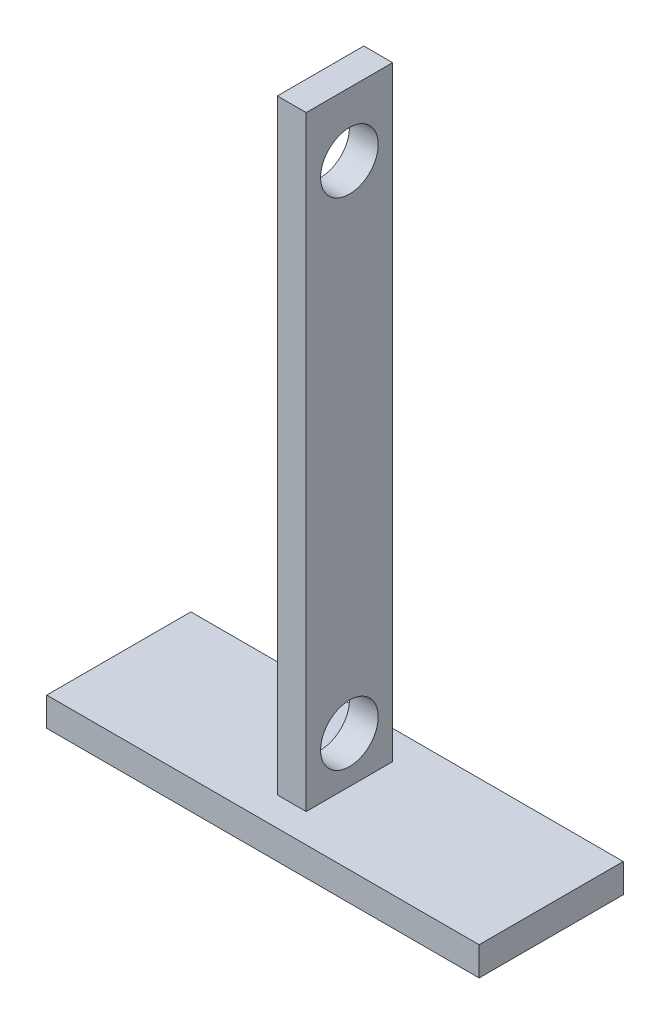
ISO-10303-21;
HEADER;
FILE_DESCRIPTION(('STEP AP214'),'2;1');
FILE_NAME('part.step','',(''),(''),'','','');
FILE_SCHEMA(('AUTOMOTIVE_DESIGN { 1 0 10303 214 1 1 1 1 }'));
ENDSEC;
DATA;
#1=APPLICATION_CONTEXT('core data for automotive mechanical design processes');
#2=APPLICATION_PROTOCOL_DEFINITION('international standard','automotive_design',2000,#1);
#3=PRODUCT_CONTEXT('',#1,'mechanical');
#4=PRODUCT('Part','Part','',(#3));
#5=PRODUCT_RELATED_PRODUCT_CATEGORY('part','',(#4));
#6=PRODUCT_DEFINITION_FORMATION('','',#4);
#7=PRODUCT_DEFINITION_CONTEXT('part definition',#1,'design');
#8=PRODUCT_DEFINITION('design','',#6,#7);
#9=PRODUCT_DEFINITION_SHAPE('','',#8);
#10=(LENGTH_UNIT() NAMED_UNIT(*) SI_UNIT(.MILLI.,.METRE.));
#11=(NAMED_UNIT(*) PLANE_ANGLE_UNIT() SI_UNIT($,.RADIAN.));
#12=(NAMED_UNIT(*) SI_UNIT($,.STERADIAN.) SOLID_ANGLE_UNIT());
#13=UNCERTAINTY_MEASURE_WITH_UNIT(LENGTH_MEASURE(1.E-05),#10,'distance_accuracy_value','');
#14=(GEOMETRIC_REPRESENTATION_CONTEXT(3) GLOBAL_UNCERTAINTY_ASSIGNED_CONTEXT((#13)) GLOBAL_UNIT_ASSIGNED_CONTEXT((#10,
#11,#12)) REPRESENTATION_CONTEXT('',''));
#15=CARTESIAN_POINT('',(0.,0.,0.));
#16=DIRECTION('',(0.,0.,1.));
#17=DIRECTION('',(1.,0.,0.));
#18=AXIS2_PLACEMENT_3D('',#15,#16,#17);
#19=CARTESIAN_POINT('',(0.,5.,0.));
#20=DIRECTION('',(0.,1.,0.));
#21=DIRECTION('',(0.,0.,1.));
#22=AXIS2_PLACEMENT_3D('',#19,#20,#21);
#23=PLANE('',#22);
#24=DIRECTION('',(0.,0.,1.));
#25=VECTOR('',#24,1.);
#26=CARTESIAN_POINT('',(46.8817116823951,5.,-16.25));
#27=LINE('',#26,#25);
#28=CARTESIAN_POINT('',(46.8817116823951,5.,-16.25));
#29=VERTEX_POINT('',#28);
#30=CARTESIAN_POINT('',(46.8817116823951,5.,8.75));
#31=VERTEX_POINT('',#30);
#32=EDGE_CURVE('E145',#29,#31,#27,.T.);
#33=ORIENTED_EDGE('',*,*,#32,.T.);
#34=DIRECTION('',(1.,0.,0.));
#35=VECTOR('',#34,1.);
#36=CARTESIAN_POINT('',(46.8817116823951,5.,8.75));
#37=LINE('',#36,#35);
#38=CARTESIAN_POINT('',(121.881711682395,5.,8.75));
#39=VERTEX_POINT('',#38);
#40=EDGE_CURVE('E90',#31,#39,#37,.T.);
#41=ORIENTED_EDGE('',*,*,#40,.T.);
#42=DIRECTION('',(0.,0.,-1.));
#43=VECTOR('',#42,1.);
#44=CARTESIAN_POINT('',(121.881711682395,5.,-16.25));
#45=LINE('',#44,#43);
#46=CARTESIAN_POINT('',(121.881711682395,5.,-16.25));
#47=VERTEX_POINT('',#46);
#48=EDGE_CURVE('E148',#39,#47,#45,.T.);
#49=ORIENTED_EDGE('',*,*,#48,.T.);
#50=DIRECTION('',(-1.,0.,0.));
#51=VECTOR('',#50,1.);
#52=CARTESIAN_POINT('',(46.8817116823951,5.,-16.25));
#53=LINE('',#52,#51);
#54=EDGE_CURVE('E62',#47,#29,#53,.T.);
#55=ORIENTED_EDGE('',*,*,#54,.T.);
#56=EDGE_LOOP('',(#33,#41,#49,#55));
#57=FACE_BOUND('',#56,.T.);
#58=DIRECTION('',(1.,0.,0.));
#59=VECTOR('',#58,1.);
#60=CARTESIAN_POINT('',(86.8817116823951,5.,3.75));
#61=LINE('',#60,#59);
#62=CARTESIAN_POINT('',(81.8817116823951,5.,3.75));
#63=VERTEX_POINT('',#62);
#64=CARTESIAN_POINT('',(86.8817116823951,5.,3.75));
#65=VERTEX_POINT('',#64);
#66=EDGE_CURVE('E165',#63,#65,#61,.T.);
#67=ORIENTED_EDGE('',*,*,#66,.F.);
#68=DIRECTION('',(0.,0.,1.));
#69=VECTOR('',#68,1.);
#70=CARTESIAN_POINT('',(81.8817116823951,5.,-11.25));
#71=LINE('',#70,#69);
#72=CARTESIAN_POINT('',(81.8817116823951,5.,-11.25));
#73=VERTEX_POINT('',#72);
#74=EDGE_CURVE('E135',#73,#63,#71,.T.);
#75=ORIENTED_EDGE('',*,*,#74,.F.);
#76=DIRECTION('',(-1.,0.,0.));
#77=VECTOR('',#76,1.);
#78=CARTESIAN_POINT('',(86.8817116823951,5.,-11.25));
#79=LINE('',#78,#77);
#80=CARTESIAN_POINT('',(86.8817116823951,5.,-11.25));
#81=VERTEX_POINT('',#80);
#82=EDGE_CURVE('E131',#81,#73,#79,.T.);
#83=ORIENTED_EDGE('',*,*,#82,.F.);
#84=DIRECTION('',(0.,0.,-1.));
#85=VECTOR('',#84,1.);
#86=CARTESIAN_POINT('',(86.8817116823951,5.,-11.25));
#87=LINE('',#86,#85);
#88=EDGE_CURVE('E179',#65,#81,#87,.T.);
#89=ORIENTED_EDGE('',*,*,#88,.F.);
#90=EDGE_LOOP('',(#67,#75,#83,#89));
#91=FACE_BOUND('',#90,.T.);
#92=ADVANCED_FACE('F36',(#57,#91),#23,.T.);
#93=CARTESIAN_POINT('',(46.8817116823951,5.,-16.25));
#94=DIRECTION('',(1.,0.,0.));
#95=DIRECTION('',(0.,0.,-1.));
#96=AXIS2_PLACEMENT_3D('',#93,#94,#95);
#97=PLANE('',#96);
#98=DIRECTION('',(0.,0.,1.));
#99=VECTOR('',#98,1.);
#100=CARTESIAN_POINT('',(46.8817116823951,0.,-16.25));
#101=LINE('',#100,#99);
#102=CARTESIAN_POINT('',(46.8817116823951,0.,-16.25));
#103=VERTEX_POINT('',#102);
#104=CARTESIAN_POINT('',(46.8817116823951,0.,8.75));
#105=VERTEX_POINT('',#104);
#106=EDGE_CURVE('E137',#103,#105,#101,.T.);
#107=ORIENTED_EDGE('',*,*,#106,.T.);
#108=DIRECTION('',(0.,-1.,0.));
#109=VECTOR('',#108,1.);
#110=CARTESIAN_POINT('',(46.8817116823951,5.,8.75));
#111=LINE('',#110,#109);
#112=EDGE_CURVE('E11',#31,#105,#111,.T.);
#113=ORIENTED_EDGE('',*,*,#112,.F.);
#114=ORIENTED_EDGE('',*,*,#32,.F.);
#115=DIRECTION('',(0.,-1.,0.));
#116=VECTOR('',#115,1.);
#117=CARTESIAN_POINT('',(46.8817116823951,5.,-16.25));
#118=LINE('',#117,#116);
#119=EDGE_CURVE('E150',#29,#103,#118,.T.);
#120=ORIENTED_EDGE('',*,*,#119,.T.);
#121=EDGE_LOOP('',(#107,#113,#114,#120));
#122=FACE_BOUND('',#121,.T.);
#123=ADVANCED_FACE('F38',(#122),#97,.F.);
#124=CARTESIAN_POINT('',(46.8817116823951,5.,8.75));
#125=DIRECTION('',(0.,0.,-1.));
#126=DIRECTION('',(-1.,0.,0.));
#127=AXIS2_PLACEMENT_3D('',#124,#125,#126);
#128=PLANE('',#127);
#129=DIRECTION('',(1.,0.,0.));
#130=VECTOR('',#129,1.);
#131=CARTESIAN_POINT('',(46.8817116823951,0.,8.75));
#132=LINE('',#131,#130);
#133=CARTESIAN_POINT('',(121.881711682395,0.,8.75));
#134=VERTEX_POINT('',#133);
#135=EDGE_CURVE('E140',#105,#134,#132,.T.);
#136=ORIENTED_EDGE('',*,*,#135,.T.);
#137=DIRECTION('',(0.,-1.,0.));
#138=VECTOR('',#137,1.);
#139=CARTESIAN_POINT('',(121.881711682395,5.,8.75));
#140=LINE('',#139,#138);
#141=EDGE_CURVE('E45',#39,#134,#140,.T.);
#142=ORIENTED_EDGE('',*,*,#141,.F.);
#143=ORIENTED_EDGE('',*,*,#40,.F.);
#144=ORIENTED_EDGE('',*,*,#112,.T.);
#145=EDGE_LOOP('',(#136,#142,#143,#144));
#146=FACE_BOUND('',#145,.T.);
#147=ADVANCED_FACE('F203',(#146),#128,.F.);
#148=CARTESIAN_POINT('',(121.881711682395,5.,-16.25));
#149=DIRECTION('',(-1.,0.,0.));
#150=DIRECTION('',(0.,0.,1.));
#151=AXIS2_PLACEMENT_3D('',#148,#149,#150);
#152=PLANE('',#151);
#153=DIRECTION('',(0.,0.,-1.));
#154=VECTOR('',#153,1.);
#155=CARTESIAN_POINT('',(121.881711682395,0.,-16.25));
#156=LINE('',#155,#154);
#157=CARTESIAN_POINT('',(121.881711682395,0.,-16.25));
#158=VERTEX_POINT('',#157);
#159=EDGE_CURVE('E153',#134,#158,#156,.T.);
#160=ORIENTED_EDGE('',*,*,#159,.T.);
#161=DIRECTION('',(0.,-1.,0.));
#162=VECTOR('',#161,1.);
#163=CARTESIAN_POINT('',(121.881711682395,5.,-16.25));
#164=LINE('',#163,#162);
#165=EDGE_CURVE('E157',#47,#158,#164,.T.);
#166=ORIENTED_EDGE('',*,*,#165,.F.);
#167=ORIENTED_EDGE('',*,*,#48,.F.);
#168=ORIENTED_EDGE('',*,*,#141,.T.);
#169=EDGE_LOOP('',(#160,#166,#167,#168));
#170=FACE_BOUND('',#169,.T.);
#171=ADVANCED_FACE('F215',(#170),#152,.F.);
#172=CARTESIAN_POINT('',(46.8817116823951,5.,-16.25));
#173=DIRECTION('',(0.,0.,1.));
#174=DIRECTION('',(1.,0.,0.));
#175=AXIS2_PLACEMENT_3D('',#172,#173,#174);
#176=PLANE('',#175);
#177=DIRECTION('',(-1.,0.,0.));
#178=VECTOR('',#177,1.);
#179=CARTESIAN_POINT('',(46.8817116823951,0.,-16.25));
#180=LINE('',#179,#178);
#181=EDGE_CURVE('E83',#158,#103,#180,.T.);
#182=ORIENTED_EDGE('',*,*,#181,.T.);
#183=ORIENTED_EDGE('',*,*,#119,.F.);
#184=ORIENTED_EDGE('',*,*,#54,.F.);
#185=ORIENTED_EDGE('',*,*,#165,.T.);
#186=EDGE_LOOP('',(#182,#183,#184,#185));
#187=FACE_BOUND('',#186,.T.);
#188=ADVANCED_FACE('F211',(#187),#176,.F.);
#189=CARTESIAN_POINT('',(0.,0.,0.));
#190=DIRECTION('',(0.,1.,0.));
#191=DIRECTION('',(0.,0.,1.));
#192=AXIS2_PLACEMENT_3D('',#189,#190,#191);
#193=PLANE('',#192);
#194=ORIENTED_EDGE('',*,*,#106,.F.);
#195=ORIENTED_EDGE('',*,*,#181,.F.);
#196=ORIENTED_EDGE('',*,*,#159,.F.);
#197=ORIENTED_EDGE('',*,*,#135,.F.);
#198=EDGE_LOOP('',(#194,#195,#196,#197));
#199=FACE_BOUND('',#198,.T.);
#200=ADVANCED_FACE('F208',(#199),#193,.F.);
#201=CARTESIAN_POINT('',(81.8817116823951,110.,-11.25));
#202=DIRECTION('',(1.,0.,0.));
#203=DIRECTION('',(0.,0.,-1.));
#204=AXIS2_PLACEMENT_3D('',#201,#202,#203);
#205=PLANE('',#204);
#206=CARTESIAN_POINT('',(81.8817116823951,99.,-3.75));
#207=DIRECTION('',(-1.,0.,0.));
#208=DIRECTION('',(0.,0.,1.));
#209=AXIS2_PLACEMENT_3D('',#206,#207,#208);
#210=CIRCLE('',#209,5.00000000000001);
#211=CARTESIAN_POINT('',(81.8817116823951,99.,1.25000000000001));
#212=VERTEX_POINT('',#211);
#213=EDGE_CURVE('E172',#212,#212,#210,.T.);
#214=ORIENTED_EDGE('',*,*,#213,.F.);
#215=EDGE_LOOP('',(#214));
#216=FACE_BOUND('',#215,.T.);
#217=CARTESIAN_POINT('',(81.8817116823951,13.,-3.74999999999999));
#218=DIRECTION('',(-1.,0.,0.));
#219=DIRECTION('',(0.,0.,1.));
#220=AXIS2_PLACEMENT_3D('',#217,#218,#219);
#221=CIRCLE('',#220,5.);
#222=CARTESIAN_POINT('',(81.8817116823951,13.,1.25000000000001));
#223=VERTEX_POINT('',#222);
#224=EDGE_CURVE('E162',#223,#223,#221,.T.);
#225=ORIENTED_EDGE('',*,*,#224,.F.);
#226=EDGE_LOOP('',(#225));
#227=FACE_BOUND('',#226,.T.);
#228=ORIENTED_EDGE('',*,*,#74,.T.);
#229=DIRECTION('',(0.,-1.,0.));
#230=VECTOR('',#229,1.);
#231=CARTESIAN_POINT('',(81.8817116823951,110.,3.75));
#232=LINE('',#231,#230);
#233=CARTESIAN_POINT('',(81.8817116823951,110.,3.75));
#234=VERTEX_POINT('',#233);
#235=EDGE_CURVE('E116',#234,#63,#232,.T.);
#236=ORIENTED_EDGE('',*,*,#235,.F.);
#237=DIRECTION('',(0.,0.,1.));
#238=VECTOR('',#237,1.);
#239=CARTESIAN_POINT('',(81.8817116823951,110.,-11.25));
#240=LINE('',#239,#238);
#241=CARTESIAN_POINT('',(81.8817116823951,110.,-11.25));
#242=VERTEX_POINT('',#241);
#243=EDGE_CURVE('E123',#242,#234,#240,.T.);
#244=ORIENTED_EDGE('',*,*,#243,.F.);
#245=DIRECTION('',(0.,-1.,0.));
#246=VECTOR('',#245,1.);
#247=CARTESIAN_POINT('',(81.8817116823951,110.,-11.25));
#248=LINE('',#247,#246);
#249=EDGE_CURVE('E176',#242,#73,#248,.T.);
#250=ORIENTED_EDGE('',*,*,#249,.T.);
#251=EDGE_LOOP('',(#228,#236,#244,#250));
#252=FACE_BOUND('',#251,.T.);
#253=ADVANCED_FACE('F133',(#216,#227,#252),#205,.F.);
#254=CARTESIAN_POINT('',(86.8817116823951,110.,3.75));
#255=DIRECTION('',(0.,0.,-1.));
#256=DIRECTION('',(-1.,0.,0.));
#257=AXIS2_PLACEMENT_3D('',#254,#255,#256);
#258=PLANE('',#257);
#259=ORIENTED_EDGE('',*,*,#66,.T.);
#260=DIRECTION('',(0.,-1.,0.));
#261=VECTOR('',#260,1.);
#262=CARTESIAN_POINT('',(86.8817116823951,110.,3.75));
#263=LINE('',#262,#261);
#264=CARTESIAN_POINT('',(86.8817116823951,110.,3.75));
#265=VERTEX_POINT('',#264);
#266=EDGE_CURVE('E119',#265,#65,#263,.T.);
#267=ORIENTED_EDGE('',*,*,#266,.F.);
#268=DIRECTION('',(1.,0.,0.));
#269=VECTOR('',#268,1.);
#270=CARTESIAN_POINT('',(86.8817116823951,110.,3.75));
#271=LINE('',#270,#269);
#272=EDGE_CURVE('E112',#234,#265,#271,.T.);
#273=ORIENTED_EDGE('',*,*,#272,.F.);
#274=ORIENTED_EDGE('',*,*,#235,.T.);
#275=EDGE_LOOP('',(#259,#267,#273,#274));
#276=FACE_BOUND('',#275,.T.);
#277=ADVANCED_FACE('F114',(#276),#258,.F.);
#278=CARTESIAN_POINT('',(86.8817116823951,110.,-11.25));
#279=DIRECTION('',(-1.,0.,0.));
#280=DIRECTION('',(0.,0.,1.));
#281=AXIS2_PLACEMENT_3D('',#278,#279,#280);
#282=PLANE('',#281);
#283=CARTESIAN_POINT('',(86.8817116823951,99.,-3.75));
#284=DIRECTION('',(-1.,0.,0.));
#285=DIRECTION('',(0.,0.,1.));
#286=AXIS2_PLACEMENT_3D('',#283,#284,#285);
#287=CIRCLE('',#286,5.00000000000001);
#288=CARTESIAN_POINT('',(86.8817116823951,99.,1.25000000000001));
#289=VERTEX_POINT('',#288);
#290=EDGE_CURVE('E40',#289,#289,#287,.T.);
#291=ORIENTED_EDGE('',*,*,#290,.T.);
#292=EDGE_LOOP('',(#291));
#293=FACE_BOUND('',#292,.T.);
#294=CARTESIAN_POINT('',(86.8817116823951,13.,-3.74999999999999));
#295=DIRECTION('',(-1.,0.,0.));
#296=DIRECTION('',(0.,0.,1.));
#297=AXIS2_PLACEMENT_3D('',#294,#295,#296);
#298=CIRCLE('',#297,5.);
#299=CARTESIAN_POINT('',(86.8817116823951,13.,1.25000000000001));
#300=VERTEX_POINT('',#299);
#301=EDGE_CURVE('E160',#300,#300,#298,.T.);
#302=ORIENTED_EDGE('',*,*,#301,.T.);
#303=EDGE_LOOP('',(#302));
#304=FACE_BOUND('',#303,.T.);
#305=ORIENTED_EDGE('',*,*,#88,.T.);
#306=DIRECTION('',(0.,-1.,0.));
#307=VECTOR('',#306,1.);
#308=CARTESIAN_POINT('',(86.8817116823951,110.,-11.25));
#309=LINE('',#308,#307);
#310=CARTESIAN_POINT('',(86.8817116823951,110.,-11.25));
#311=VERTEX_POINT('',#310);
#312=EDGE_CURVE('E53',#311,#81,#309,.T.);
#313=ORIENTED_EDGE('',*,*,#312,.F.);
#314=DIRECTION('',(0.,0.,-1.));
#315=VECTOR('',#314,1.);
#316=CARTESIAN_POINT('',(86.8817116823951,110.,-11.25));
#317=LINE('',#316,#315);
#318=EDGE_CURVE('E122',#265,#311,#317,.T.);
#319=ORIENTED_EDGE('',*,*,#318,.F.);
#320=ORIENTED_EDGE('',*,*,#266,.T.);
#321=EDGE_LOOP('',(#305,#313,#319,#320));
#322=FACE_BOUND('',#321,.T.);
#323=ADVANCED_FACE('F186',(#293,#304,#322),#282,.F.);
#324=CARTESIAN_POINT('',(86.8817116823951,110.,-11.25));
#325=DIRECTION('',(0.,0.,1.));
#326=DIRECTION('',(1.,0.,0.));
#327=AXIS2_PLACEMENT_3D('',#324,#325,#326);
#328=PLANE('',#327);
#329=ORIENTED_EDGE('',*,*,#82,.T.);
#330=ORIENTED_EDGE('',*,*,#249,.F.);
#331=DIRECTION('',(-1.,0.,0.));
#332=VECTOR('',#331,1.);
#333=CARTESIAN_POINT('',(86.8817116823951,110.,-11.25));
#334=LINE('',#333,#332);
#335=EDGE_CURVE('E127',#311,#242,#334,.T.);
#336=ORIENTED_EDGE('',*,*,#335,.F.);
#337=ORIENTED_EDGE('',*,*,#312,.T.);
#338=EDGE_LOOP('',(#329,#330,#336,#337));
#339=FACE_BOUND('',#338,.T.);
#340=ADVANCED_FACE('F187',(#339),#328,.F.);
#341=CARTESIAN_POINT('',(0.,110.,0.));
#342=DIRECTION('',(0.,-1.,0.));
#343=DIRECTION('',(0.,0.,-1.));
#344=AXIS2_PLACEMENT_3D('',#341,#342,#343);
#345=PLANE('',#344);
#346=ORIENTED_EDGE('',*,*,#243,.T.);
#347=ORIENTED_EDGE('',*,*,#272,.T.);
#348=ORIENTED_EDGE('',*,*,#318,.T.);
#349=ORIENTED_EDGE('',*,*,#335,.T.);
#350=EDGE_LOOP('',(#346,#347,#348,#349));
#351=FACE_BOUND('',#350,.T.);
#352=ADVANCED_FACE('F126',(#351),#345,.F.);
#353=CARTESIAN_POINT('',(121.881711682395,13.,-3.74999999999999));
#354=DIRECTION('',(-1.,0.,0.));
#355=DIRECTION('',(0.,0.,1.));
#356=AXIS2_PLACEMENT_3D('',#353,#354,#355);
#357=CYLINDRICAL_SURFACE('',#356,5.);
#358=ORIENTED_EDGE('',*,*,#224,.T.);
#359=EDGE_LOOP('',(#358));
#360=FACE_BOUND('',#359,.T.);
#361=ORIENTED_EDGE('',*,*,#301,.F.);
#362=EDGE_LOOP('',(#361));
#363=FACE_BOUND('',#362,.T.);
#364=ADVANCED_FACE('F194',(#360,#363),#357,.F.);
#365=CARTESIAN_POINT('',(121.881711682395,99.,-3.75));
#366=DIRECTION('',(-1.,0.,0.));
#367=DIRECTION('',(0.,0.,1.));
#368=AXIS2_PLACEMENT_3D('',#365,#366,#367);
#369=CYLINDRICAL_SURFACE('',#368,5.00000000000001);
#370=ORIENTED_EDGE('',*,*,#213,.T.);
#371=EDGE_LOOP('',(#370));
#372=FACE_BOUND('',#371,.T.);
#373=ORIENTED_EDGE('',*,*,#290,.F.);
#374=EDGE_LOOP('',(#373));
#375=FACE_BOUND('',#374,.T.);
#376=ADVANCED_FACE('F263',(#372,#375),#369,.F.);
#377=CLOSED_SHELL('',(#92,#123,#147,#171,#188,#200,#253,#277,#323,#340,#352,#364,#376));
#378=MANIFOLD_SOLID_BREP('B2',#377);
#379=ADVANCED_BREP_SHAPE_REPRESENTATION('',(#18,#378),#14);
#380=SHAPE_DEFINITION_REPRESENTATION(#9,#379);
ENDSEC;
END-ISO-10303-21;
